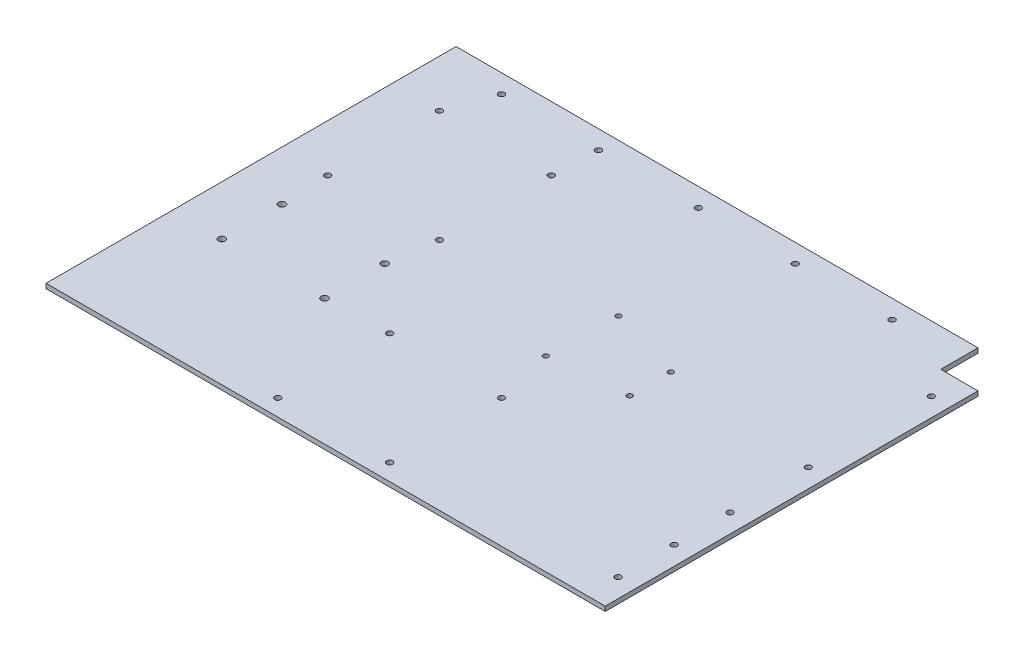
ISO-10303-21;
HEADER;
FILE_DESCRIPTION(('STEP AP214'),'2;1');
FILE_NAME('part.step','',(''),(''),'','','');
FILE_SCHEMA(('AUTOMOTIVE_DESIGN { 1 0 10303 214 1 1 1 1 }'));
ENDSEC;
DATA;
#1=APPLICATION_CONTEXT('core data for automotive mechanical design processes');
#2=APPLICATION_PROTOCOL_DEFINITION('international standard','automotive_design',2000,#1);
#3=PRODUCT_CONTEXT('',#1,'mechanical');
#4=PRODUCT('Part','Part','',(#3));
#5=PRODUCT_RELATED_PRODUCT_CATEGORY('part','',(#4));
#6=PRODUCT_DEFINITION_FORMATION('','',#4);
#7=PRODUCT_DEFINITION_CONTEXT('part definition',#1,'design');
#8=PRODUCT_DEFINITION('design','',#6,#7);
#9=PRODUCT_DEFINITION_SHAPE('','',#8);
#10=(LENGTH_UNIT() NAMED_UNIT(*) SI_UNIT(.MILLI.,.METRE.));
#11=(NAMED_UNIT(*) PLANE_ANGLE_UNIT() SI_UNIT($,.RADIAN.));
#12=(NAMED_UNIT(*) SI_UNIT($,.STERADIAN.) SOLID_ANGLE_UNIT());
#13=UNCERTAINTY_MEASURE_WITH_UNIT(LENGTH_MEASURE(1.E-05),#10,'distance_accuracy_value','');
#14=(GEOMETRIC_REPRESENTATION_CONTEXT(3) GLOBAL_UNCERTAINTY_ASSIGNED_CONTEXT((#13)) GLOBAL_UNIT_ASSIGNED_CONTEXT((#10,
#11,#12)) REPRESENTATION_CONTEXT('',''));
#15=CARTESIAN_POINT('',(0.,0.,0.));
#16=DIRECTION('',(0.,0.,1.));
#17=DIRECTION('',(1.,0.,0.));
#18=AXIS2_PLACEMENT_3D('',#15,#16,#17);
#19=CARTESIAN_POINT('',(100.800624481963,3.175,73.9204579534397));
#20=DIRECTION('',(0.,0.,1.));
#21=DIRECTION('',(1.,0.,0.));
#22=AXIS2_PLACEMENT_3D('',#19,#20,#21);
#23=PLANE('',#22);
#24=DIRECTION('',(-1.,0.,0.));
#25=VECTOR('',#24,1.);
#26=CARTESIAN_POINT('',(100.800624481963,0.,73.9204579534397));
#27=LINE('',#26,#25);
#28=CARTESIAN_POINT('',(100.800624481963,0.,73.9204579534397));
#29=VERTEX_POINT('',#28);
#30=CARTESIAN_POINT('',(-280.199375518037,0.,73.9204579534398));
#31=VERTEX_POINT('',#30);
#32=EDGE_CURVE('E122',#29,#31,#27,.T.);
#33=ORIENTED_EDGE('',*,*,#32,.F.);
#34=DIRECTION('',(0.,-1.,0.));
#35=VECTOR('',#34,1.);
#36=CARTESIAN_POINT('',(100.800624481963,3.175,73.9204579534397));
#37=LINE('',#36,#35);
#38=CARTESIAN_POINT('',(100.800624481963,3.175,73.9204579534397));
#39=VERTEX_POINT('',#38);
#40=EDGE_CURVE('E11',#39,#29,#37,.T.);
#41=ORIENTED_EDGE('',*,*,#40,.F.);
#42=DIRECTION('',(-1.,0.,0.));
#43=VECTOR('',#42,1.);
#44=CARTESIAN_POINT('',(100.800624481963,3.175,73.9204579534397));
#45=LINE('',#44,#43);
#46=CARTESIAN_POINT('',(-280.199375518037,3.175,73.9204579534398));
#47=VERTEX_POINT('',#46);
#48=EDGE_CURVE('E135',#39,#47,#45,.T.);
#49=ORIENTED_EDGE('',*,*,#48,.T.);
#50=DIRECTION('',(0.,-1.,0.));
#51=VECTOR('',#50,1.);
#52=CARTESIAN_POINT('',(-280.199375518037,3.175,73.9204579534398));
#53=LINE('',#52,#51);
#54=EDGE_CURVE('E39',#47,#31,#53,.T.);
#55=ORIENTED_EDGE('',*,*,#54,.T.);
#56=EDGE_LOOP('',(#33,#41,#49,#55));
#57=FACE_BOUND('',#56,.T.);
#58=ADVANCED_FACE('F36',(#57),#23,.T.);
#59=CARTESIAN_POINT('',(100.800624481963,3.175,73.9204579534397));
#60=DIRECTION('',(-1.,0.,0.));
#61=DIRECTION('',(0.,0.,1.));
#62=AXIS2_PLACEMENT_3D('',#59,#60,#61);
#63=PLANE('',#62);
#64=DIRECTION('',(0.,0.,-1.));
#65=VECTOR('',#64,1.);
#66=CARTESIAN_POINT('',(100.800624481963,0.,73.9204579534397));
#67=LINE('',#66,#65);
#68=CARTESIAN_POINT('',(100.800624481963,0.,-180.07954204656));
#69=VERTEX_POINT('',#68);
#70=EDGE_CURVE('E75',#29,#69,#67,.T.);
#71=ORIENTED_EDGE('',*,*,#70,.T.);
#72=DIRECTION('',(0.,-1.,0.));
#73=VECTOR('',#72,1.);
#74=CARTESIAN_POINT('',(100.800624481963,3.175,-180.07954204656));
#75=LINE('',#74,#73);
#76=CARTESIAN_POINT('',(100.800624481963,3.175,-180.07954204656));
#77=VERTEX_POINT('',#76);
#78=EDGE_CURVE('E45',#77,#69,#75,.T.);
#79=ORIENTED_EDGE('',*,*,#78,.F.);
#80=DIRECTION('',(0.,0.,-1.));
#81=VECTOR('',#80,1.);
#82=CARTESIAN_POINT('',(100.800624481963,3.175,73.9204579534397));
#83=LINE('',#82,#81);
#84=EDGE_CURVE('E100',#39,#77,#83,.T.);
#85=ORIENTED_EDGE('',*,*,#84,.F.);
#86=ORIENTED_EDGE('',*,*,#40,.T.);
#87=EDGE_LOOP('',(#71,#79,#85,#86));
#88=FACE_BOUND('',#87,.T.);
#89=ADVANCED_FACE('F377',(#88),#63,.F.);
#90=CARTESIAN_POINT('',(100.800624481963,3.175,-180.07954204656));
#91=DIRECTION('',(0.,0.,1.));
#92=DIRECTION('',(1.,0.,0.));
#93=AXIS2_PLACEMENT_3D('',#90,#91,#92);
#94=PLANE('',#93);
#95=DIRECTION('',(-1.,0.,0.));
#96=VECTOR('',#95,1.);
#97=CARTESIAN_POINT('',(100.800624481963,0.,-180.07954204656));
#98=LINE('',#97,#96);
#99=CARTESIAN_POINT('',(75.4006244819632,0.,-180.07954204656));
#100=VERTEX_POINT('',#99);
#101=EDGE_CURVE('E107',#69,#100,#98,.T.);
#102=ORIENTED_EDGE('',*,*,#101,.T.);
#103=DIRECTION('',(0.,-1.,0.));
#104=VECTOR('',#103,1.);
#105=CARTESIAN_POINT('',(75.4006244819632,3.175,-180.07954204656));
#106=LINE('',#105,#104);
#107=CARTESIAN_POINT('',(75.4006244819632,3.175,-180.07954204656));
#108=VERTEX_POINT('',#107);
#109=EDGE_CURVE('E104',#108,#100,#106,.T.);
#110=ORIENTED_EDGE('',*,*,#109,.F.);
#111=DIRECTION('',(-1.,0.,0.));
#112=VECTOR('',#111,1.);
#113=CARTESIAN_POINT('',(100.800624481963,3.175,-180.07954204656));
#114=LINE('',#113,#112);
#115=EDGE_CURVE('E93',#77,#108,#114,.T.);
#116=ORIENTED_EDGE('',*,*,#115,.F.);
#117=ORIENTED_EDGE('',*,*,#78,.T.);
#118=EDGE_LOOP('',(#102,#110,#116,#117));
#119=FACE_BOUND('',#118,.T.);
#120=ADVANCED_FACE('F105',(#119),#94,.F.);
#121=CARTESIAN_POINT('',(75.4006244819632,3.175,-180.07954204656));
#122=DIRECTION('',(-1.,0.,0.));
#123=DIRECTION('',(0.,0.,1.));
#124=AXIS2_PLACEMENT_3D('',#121,#122,#123);
#125=PLANE('',#124);
#126=DIRECTION('',(0.,0.,-1.));
#127=VECTOR('',#126,1.);
#128=CARTESIAN_POINT('',(75.4006244819632,0.,-180.07954204656));
#129=LINE('',#128,#127);
#130=CARTESIAN_POINT('',(75.4006244819632,0.,-205.47954204656));
#131=VERTEX_POINT('',#130);
#132=EDGE_CURVE('E132',#100,#131,#129,.T.);
#133=ORIENTED_EDGE('',*,*,#132,.T.);
#134=DIRECTION('',(0.,-1.,0.));
#135=VECTOR('',#134,1.);
#136=CARTESIAN_POINT('',(75.4006244819632,3.175,-205.47954204656));
#137=LINE('',#136,#135);
#138=CARTESIAN_POINT('',(75.4006244819632,3.175,-205.47954204656));
#139=VERTEX_POINT('',#138);
#140=EDGE_CURVE('E110',#139,#131,#137,.T.);
#141=ORIENTED_EDGE('',*,*,#140,.F.);
#142=DIRECTION('',(0.,0.,-1.));
#143=VECTOR('',#142,1.);
#144=CARTESIAN_POINT('',(75.4006244819632,3.175,-180.07954204656));
#145=LINE('',#144,#143);
#146=EDGE_CURVE('E98',#108,#139,#145,.T.);
#147=ORIENTED_EDGE('',*,*,#146,.F.);
#148=ORIENTED_EDGE('',*,*,#109,.T.);
#149=EDGE_LOOP('',(#133,#141,#147,#148));
#150=FACE_BOUND('',#149,.T.);
#151=ADVANCED_FACE('F112',(#150),#125,.F.);
#152=CARTESIAN_POINT('',(75.4006244819632,3.175,-205.47954204656));
#153=DIRECTION('',(0.,0.,1.));
#154=DIRECTION('',(1.,0.,0.));
#155=AXIS2_PLACEMENT_3D('',#152,#153,#154);
#156=PLANE('',#155);
#157=DIRECTION('',(-1.,0.,0.));
#158=VECTOR('',#157,1.);
#159=CARTESIAN_POINT('',(75.4006244819632,0.,-205.47954204656));
#160=LINE('',#159,#158);
#161=CARTESIAN_POINT('',(-280.199375518037,0.,-205.47954204656));
#162=VERTEX_POINT('',#161);
#163=EDGE_CURVE('E129',#131,#162,#160,.T.);
#164=ORIENTED_EDGE('',*,*,#163,.T.);
#165=DIRECTION('',(0.,-1.,0.));
#166=VECTOR('',#165,1.);
#167=CARTESIAN_POINT('',(-280.199375518037,3.175,-205.47954204656));
#168=LINE('',#167,#166);
#169=CARTESIAN_POINT('',(-280.199375518037,3.175,-205.47954204656));
#170=VERTEX_POINT('',#169);
#171=EDGE_CURVE('E138',#170,#162,#168,.T.);
#172=ORIENTED_EDGE('',*,*,#171,.F.);
#173=DIRECTION('',(-1.,0.,0.));
#174=VECTOR('',#173,1.);
#175=CARTESIAN_POINT('',(75.4006244819632,3.175,-205.47954204656));
#176=LINE('',#175,#174);
#177=EDGE_CURVE('E115',#139,#170,#176,.T.);
#178=ORIENTED_EDGE('',*,*,#177,.F.);
#179=ORIENTED_EDGE('',*,*,#140,.T.);
#180=EDGE_LOOP('',(#164,#172,#178,#179));
#181=FACE_BOUND('',#180,.T.);
#182=ADVANCED_FACE('F145',(#181),#156,.F.);
#183=CARTESIAN_POINT('',(-280.199375518037,3.175,73.9204579534398));
#184=DIRECTION('',(-1.,0.,0.));
#185=DIRECTION('',(0.,0.,1.));
#186=AXIS2_PLACEMENT_3D('',#183,#184,#185);
#187=PLANE('',#186);
#188=DIRECTION('',(0.,0.,-1.));
#189=VECTOR('',#188,1.);
#190=CARTESIAN_POINT('',(-280.199375518037,0.,73.9204579534398));
#191=LINE('',#190,#189);
#192=EDGE_CURVE('E125',#31,#162,#191,.T.);
#193=ORIENTED_EDGE('',*,*,#192,.F.);
#194=ORIENTED_EDGE('',*,*,#54,.F.);
#195=DIRECTION('',(0.,0.,-1.));
#196=VECTOR('',#195,1.);
#197=CARTESIAN_POINT('',(-280.199375518037,3.175,73.9204579534398));
#198=LINE('',#197,#196);
#199=EDGE_CURVE('E117',#47,#170,#198,.T.);
#200=ORIENTED_EDGE('',*,*,#199,.T.);
#201=ORIENTED_EDGE('',*,*,#171,.T.);
#202=EDGE_LOOP('',(#193,#194,#200,#201));
#203=FACE_BOUND('',#202,.T.);
#204=ADVANCED_FACE('F140',(#203),#187,.T.);
#205=CARTESIAN_POINT('',(0.,3.175,0.));
#206=DIRECTION('',(0.,-1.,0.));
#207=DIRECTION('',(0.,0.,-1.));
#208=AXIS2_PLACEMENT_3D('',#205,#206,#207);
#209=PLANE('',#208);
#210=CARTESIAN_POINT('',(-133.573007219996,3.175,-13.6068536262786));
#211=DIRECTION('',(0.,1.,0.));
#212=DIRECTION('',(0.,0.,1.));
#213=AXIS2_PLACEMENT_3D('',#210,#211,#212);
#214=CIRCLE('',#213,2.03200000000001);
#215=CARTESIAN_POINT('',(-133.573007219996,3.175,-11.5748536262786));
#216=VERTEX_POINT('',#215);
#217=EDGE_CURVE('E274',#216,#216,#214,.T.);
#218=ORIENTED_EDGE('',*,*,#217,.F.);
#219=EDGE_LOOP('',(#218));
#220=FACE_BOUND('',#219,.T.);
#221=CARTESIAN_POINT('',(-247.907630969314,3.175,-85.6493101095466));
#222=DIRECTION('',(0.,1.,0.));
#223=DIRECTION('',(0.,0.,1.));
#224=AXIS2_PLACEMENT_3D('',#221,#222,#223);
#225=CIRCLE('',#224,2.03200000000001);
#226=CARTESIAN_POINT('',(-247.907630969314,3.175,-83.6173101095466));
#227=VERTEX_POINT('',#226);
#228=EDGE_CURVE('E281',#227,#227,#225,.T.);
#229=ORIENTED_EDGE('',*,*,#228,.F.);
#230=EDGE_LOOP('',(#229));
#231=FACE_BOUND('',#230,.T.);
#232=CARTESIAN_POINT('',(-171.707630969314,3.175,-85.6493101095466));
#233=DIRECTION('',(0.,1.,0.));
#234=DIRECTION('',(0.,0.,1.));
#235=AXIS2_PLACEMENT_3D('',#232,#233,#234);
#236=CIRCLE('',#235,2.03200000000001);
#237=CARTESIAN_POINT('',(-171.707630969314,3.175,-83.6173101095466));
#238=VERTEX_POINT('',#237);
#239=EDGE_CURVE('E262',#238,#238,#236,.T.);
#240=ORIENTED_EDGE('',*,*,#239,.F.);
#241=EDGE_LOOP('',(#240));
#242=FACE_BOUND('',#241,.T.);
#243=CARTESIAN_POINT('',(-171.707630969314,3.175,-161.849310109547));
#244=DIRECTION('',(0.,1.,0.));
#245=DIRECTION('',(0.,0.,1.));
#246=AXIS2_PLACEMENT_3D('',#243,#244,#245);
#247=CIRCLE('',#246,2.032);
#248=CARTESIAN_POINT('',(-171.707630969314,3.175,-159.817310109547));
#249=VERTEX_POINT('',#248);
#250=EDGE_CURVE('E269',#249,#249,#247,.T.);
#251=ORIENTED_EDGE('',*,*,#250,.F.);
#252=EDGE_LOOP('',(#251));
#253=FACE_BOUND('',#252,.T.);
#254=CARTESIAN_POINT('',(-57.3730072199961,3.175,-13.6068536262786));
#255=DIRECTION('',(0.,1.,0.));
#256=DIRECTION('',(0.,0.,1.));
#257=AXIS2_PLACEMENT_3D('',#254,#255,#256);
#258=CIRCLE('',#257,2.032);
#259=CARTESIAN_POINT('',(-57.3730072199961,3.175,-11.5748536262786));
#260=VERTEX_POINT('',#259);
#261=EDGE_CURVE('E298',#260,#260,#258,.T.);
#262=ORIENTED_EDGE('',*,*,#261,.F.);
#263=EDGE_LOOP('',(#262));
#264=FACE_BOUND('',#263,.T.);
#265=CARTESIAN_POINT('',(-57.3730072199961,3.175,62.5931463737214));
#266=DIRECTION('',(0.,1.,0.));
#267=DIRECTION('',(0.,0.,1.));
#268=AXIS2_PLACEMENT_3D('',#265,#266,#267);
#269=CIRCLE('',#268,2.03199999999999);
#270=CARTESIAN_POINT('',(-57.3730072199961,3.175,64.6251463737214));
#271=VERTEX_POINT('',#270);
#272=EDGE_CURVE('E292',#271,#271,#269,.T.);
#273=ORIENTED_EDGE('',*,*,#272,.F.);
#274=EDGE_LOOP('',(#273));
#275=FACE_BOUND('',#274,.T.);
#276=CARTESIAN_POINT('',(-133.573007219996,3.175,62.5931463737214));
#277=DIRECTION('',(0.,1.,0.));
#278=DIRECTION('',(0.,0.,1.));
#279=AXIS2_PLACEMENT_3D('',#276,#277,#278);
#280=CIRCLE('',#279,2.03200000000001);
#281=CARTESIAN_POINT('',(-133.573007219996,3.175,64.6251463737214));
#282=VERTEX_POINT('',#281);
#283=EDGE_CURVE('E286',#282,#282,#280,.T.);
#284=ORIENTED_EDGE('',*,*,#283,.F.);
#285=EDGE_LOOP('',(#284));
#286=FACE_BOUND('',#285,.T.);
#287=CARTESIAN_POINT('',(-247.907630969314,3.175,-161.849310109547));
#288=DIRECTION('',(0.,1.,0.));
#289=DIRECTION('',(0.,0.,1.));
#290=AXIS2_PLACEMENT_3D('',#287,#288,#289);
#291=CIRCLE('',#290,2.032);
#292=CARTESIAN_POINT('',(-247.907630969314,3.175,-159.817310109547));
#293=VERTEX_POINT('',#292);
#294=EDGE_CURVE('E256',#293,#293,#291,.T.);
#295=ORIENTED_EDGE('',*,*,#294,.F.);
#296=EDGE_LOOP('',(#295));
#297=FACE_BOUND('',#296,.T.);
#298=CARTESIAN_POINT('',(-246.392967043811,3.175,-12.0872192801936));
#299=DIRECTION('',(0.,1.,0.));
#300=DIRECTION('',(0.,0.,1.));
#301=AXIS2_PLACEMENT_3D('',#298,#299,#300);
#302=CIRCLE('',#301,2.34746475532095);
#303=CARTESIAN_POINT('',(-246.392967043811,3.175,-9.73975452487267));
#304=VERTEX_POINT('',#303);
#305=EDGE_CURVE('E238',#304,#304,#302,.T.);
#306=ORIENTED_EDGE('',*,*,#305,.F.);
#307=EDGE_LOOP('',(#306));
#308=FACE_BOUND('',#307,.T.);
#309=CARTESIAN_POINT('',(-176.42696274833,3.175,-12.0872192801936));
#310=DIRECTION('',(0.,1.,0.));
#311=DIRECTION('',(0.,0.,1.));
#312=AXIS2_PLACEMENT_3D('',#309,#310,#311);
#313=CIRCLE('',#312,2.34746475532092);
#314=CARTESIAN_POINT('',(-176.42696274833,3.175,-9.73975452487272));
#315=VERTEX_POINT('',#314);
#316=EDGE_CURVE('E245',#315,#315,#313,.T.);
#317=ORIENTED_EDGE('',*,*,#316,.F.);
#318=EDGE_LOOP('',(#317));
#319=FACE_BOUND('',#318,.T.);
#320=CARTESIAN_POINT('',(-176.42696274833,3.175,-53.0795420465603));
#321=DIRECTION('',(0.,1.,0.));
#322=DIRECTION('',(0.,0.,1.));
#323=AXIS2_PLACEMENT_3D('',#320,#321,#322);
#324=CIRCLE('',#323,2.34746475532095);
#325=CARTESIAN_POINT('',(-176.42696274833,3.175,-50.7320772912394));
#326=VERTEX_POINT('',#325);
#327=EDGE_CURVE('E251',#326,#326,#324,.T.);
#328=ORIENTED_EDGE('',*,*,#327,.F.);
#329=EDGE_LOOP('',(#328));
#330=FACE_BOUND('',#329,.T.);
#331=CARTESIAN_POINT('',(-246.392967043811,3.175,-53.0795420465603));
#332=DIRECTION('',(0.,1.,0.));
#333=DIRECTION('',(0.,0.,1.));
#334=AXIS2_PLACEMENT_3D('',#331,#332,#333);
#335=CIRCLE('',#334,2.34746475532092);
#336=CARTESIAN_POINT('',(-246.392967043811,3.175,-50.7320772912394));
#337=VERTEX_POINT('',#336);
#338=EDGE_CURVE('E232',#337,#337,#335,.T.);
#339=ORIENTED_EDGE('',*,*,#338,.F.);
#340=EDGE_LOOP('',(#339));
#341=FACE_BOUND('',#340,.T.);
#342=CARTESIAN_POINT('',(-65.7828975691929,3.175,-101.772937610948));
#343=DIRECTION('',(0.,1.,0.));
#344=DIRECTION('',(0.,0.,1.));
#345=AXIS2_PLACEMENT_3D('',#342,#343,#344);
#346=CIRCLE('',#345,1.77799999999999);
#347=CARTESIAN_POINT('',(-65.7828975691929,3.175,-99.994937610948));
#348=VERTEX_POINT('',#347);
#349=EDGE_CURVE('E214',#348,#348,#346,.T.);
#350=ORIENTED_EDGE('',*,*,#349,.F.);
#351=EDGE_LOOP('',(#350));
#352=FACE_BOUND('',#351,.T.);
#353=CARTESIAN_POINT('',(-67.0528975691929,3.175,-53.512937610948));
#354=DIRECTION('',(0.,1.,0.));
#355=DIRECTION('',(0.,0.,1.));
#356=AXIS2_PLACEMENT_3D('',#353,#354,#355);
#357=CIRCLE('',#356,1.77799999999999);
#358=CARTESIAN_POINT('',(-67.0528975691929,3.175,-51.734937610948));
#359=VERTEX_POINT('',#358);
#360=EDGE_CURVE('E221',#359,#359,#357,.T.);
#361=ORIENTED_EDGE('',*,*,#360,.F.);
#362=EDGE_LOOP('',(#361));
#363=FACE_BOUND('',#362,.T.);
#364=CARTESIAN_POINT('',(-14.9828975691929,3.175,-58.592937610948));
#365=DIRECTION('',(0.,1.,0.));
#366=DIRECTION('',(0.,0.,1.));
#367=AXIS2_PLACEMENT_3D('',#364,#365,#366);
#368=CIRCLE('',#367,1.77799999999999);
#369=CARTESIAN_POINT('',(-14.9828975691929,3.175,-56.814937610948));
#370=VERTEX_POINT('',#369);
#371=EDGE_CURVE('E227',#370,#370,#368,.T.);
#372=ORIENTED_EDGE('',*,*,#371,.F.);
#373=EDGE_LOOP('',(#372));
#374=FACE_BOUND('',#373,.T.);
#375=CARTESIAN_POINT('',(-14.9828975691929,3.175,-86.532937610948));
#376=DIRECTION('',(0.,1.,0.));
#377=DIRECTION('',(0.,0.,1.));
#378=AXIS2_PLACEMENT_3D('',#375,#376,#377);
#379=CIRCLE('',#378,1.778);
#380=CARTESIAN_POINT('',(-14.9828975691929,3.175,-84.754937610948));
#381=VERTEX_POINT('',#380);
#382=EDGE_CURVE('E208',#381,#381,#379,.T.);
#383=ORIENTED_EDGE('',*,*,#382,.F.);
#384=EDGE_LOOP('',(#383));
#385=FACE_BOUND('',#384,.T.);
#386=CARTESIAN_POINT('',(88.1006244819632,3.175,-161.02954204656));
#387=DIRECTION('',(0.,1.,0.));
#388=DIRECTION('',(0.,0.,1.));
#389=AXIS2_PLACEMENT_3D('',#386,#387,#388);
#390=CIRCLE('',#389,2.032);
#391=CARTESIAN_POINT('',(88.1006244819632,3.175,-158.99754204656));
#392=VERTEX_POINT('',#391);
#393=EDGE_CURVE('E203',#392,#392,#390,.T.);
#394=ORIENTED_EDGE('',*,*,#393,.F.);
#395=EDGE_LOOP('',(#394));
#396=FACE_BOUND('',#395,.T.);
#397=CARTESIAN_POINT('',(88.1006244819632,3.175,-77.2095420465603));
#398=DIRECTION('',(0.,1.,0.));
#399=DIRECTION('',(0.,0.,1.));
#400=AXIS2_PLACEMENT_3D('',#397,#398,#399);
#401=CIRCLE('',#400,2.03200000000001);
#402=CARTESIAN_POINT('',(88.1006244819632,3.175,-75.1775420465603));
#403=VERTEX_POINT('',#402);
#404=EDGE_CURVE('E197',#403,#403,#401,.T.);
#405=ORIENTED_EDGE('',*,*,#404,.F.);
#406=EDGE_LOOP('',(#405));
#407=FACE_BOUND('',#406,.T.);
#408=CARTESIAN_POINT('',(88.1006244819632,3.175,-23.8202508425131));
#409=DIRECTION('',(0.,1.,0.));
#410=DIRECTION('',(0.,0.,1.));
#411=AXIS2_PLACEMENT_3D('',#408,#409,#410);
#412=CIRCLE('',#411,2.03200000000001);
#413=CARTESIAN_POINT('',(88.1006244819632,3.175,-21.7882508425131));
#414=VERTEX_POINT('',#413);
#415=EDGE_CURVE('E191',#414,#414,#412,.T.);
#416=ORIENTED_EDGE('',*,*,#415,.F.);
#417=EDGE_LOOP('',(#416));
#418=FACE_BOUND('',#417,.T.);
#419=CARTESIAN_POINT('',(88.1006244819636,3.175,14.2797491574869));
#420=DIRECTION('',(0.,1.,0.));
#421=DIRECTION('',(0.,0.,1.));
#422=AXIS2_PLACEMENT_3D('',#419,#420,#421);
#423=CIRCLE('',#422,2.03200000000001);
#424=CARTESIAN_POINT('',(88.1006244819636,3.175,16.3117491574869));
#425=VERTEX_POINT('',#424);
#426=EDGE_CURVE('E185',#425,#425,#423,.T.);
#427=ORIENTED_EDGE('',*,*,#426,.F.);
#428=EDGE_LOOP('',(#427));
#429=FACE_BOUND('',#428,.T.);
#430=CARTESIAN_POINT('',(88.100624481964,3.175,52.3797491574869));
#431=DIRECTION('',(0.,1.,0.));
#432=DIRECTION('',(0.,0.,1.));
#433=AXIS2_PLACEMENT_3D('',#430,#431,#432);
#434=CIRCLE('',#433,2.03200000000001);
#435=CARTESIAN_POINT('',(88.100624481964,3.175,54.4117491574869));
#436=VERTEX_POINT('',#435);
#437=EDGE_CURVE('E178',#436,#436,#434,.T.);
#438=ORIENTED_EDGE('',*,*,#437,.F.);
#439=EDGE_LOOP('',(#438));
#440=FACE_BOUND('',#439,.T.);
#441=CARTESIAN_POINT('',(-102.399375518037,3.175,-192.77954204656));
#442=DIRECTION('',(0.,1.,0.));
#443=DIRECTION('',(0.,0.,1.));
#444=AXIS2_PLACEMENT_3D('',#441,#442,#443);
#445=CIRCLE('',#444,2.032);
#446=CARTESIAN_POINT('',(-102.399375518037,3.175,-190.74754204656));
#447=VERTEX_POINT('',#446);
#448=EDGE_CURVE('E161',#447,#447,#445,.T.);
#449=ORIENTED_EDGE('',*,*,#448,.F.);
#450=EDGE_LOOP('',(#449));
#451=FACE_BOUND('',#450,.T.);
#452=CARTESIAN_POINT('',(-36.4851982812551,3.175,-192.77954204656));
#453=DIRECTION('',(0.,1.,0.));
#454=DIRECTION('',(0.,0.,1.));
#455=AXIS2_PLACEMENT_3D('',#452,#453,#454);
#456=CIRCLE('',#455,2.032);
#457=CARTESIAN_POINT('',(-36.4851982812551,3.175,-190.74754204656));
#458=VERTEX_POINT('',#457);
#459=EDGE_CURVE('E154',#458,#458,#456,.T.);
#460=ORIENTED_EDGE('',*,*,#459,.F.);
#461=EDGE_LOOP('',(#460));
#462=FACE_BOUND('',#461,.T.);
#463=CARTESIAN_POINT('',(-236.544769223729,3.175,-192.77954204656));
#464=DIRECTION('',(0.,1.,0.));
#465=DIRECTION('',(0.,0.,1.));
#466=AXIS2_PLACEMENT_3D('',#463,#464,#465);
#467=CIRCLE('',#466,2.032);
#468=CARTESIAN_POINT('',(-236.544769223729,3.175,-190.74754204656));
#469=VERTEX_POINT('',#468);
#470=EDGE_CURVE('E173',#469,#469,#467,.T.);
#471=ORIENTED_EDGE('',*,*,#470,.F.);
#472=EDGE_LOOP('',(#471));
#473=FACE_BOUND('',#472,.T.);
#474=CARTESIAN_POINT('',(29.5548017187449,3.175,-192.77954204656));
#475=DIRECTION('',(0.,1.,0.));
#476=DIRECTION('',(0.,0.,1.));
#477=AXIS2_PLACEMENT_3D('',#474,#475,#476);
#478=CIRCLE('',#477,2.032);
#479=CARTESIAN_POINT('',(29.5548017187449,3.175,-190.74754204656));
#480=VERTEX_POINT('',#479);
#481=EDGE_CURVE('E166',#480,#480,#478,.T.);
#482=ORIENTED_EDGE('',*,*,#481,.F.);
#483=EDGE_LOOP('',(#482));
#484=FACE_BOUND('',#483,.T.);
#485=CARTESIAN_POINT('',(-170.504769223729,3.175,-192.77954204656));
#486=DIRECTION('',(0.,1.,0.));
#487=DIRECTION('',(0.,0.,1.));
#488=AXIS2_PLACEMENT_3D('',#485,#486,#487);
#489=CIRCLE('',#488,2.032);
#490=CARTESIAN_POINT('',(-170.504769223729,3.175,-190.74754204656));
#491=VERTEX_POINT('',#490);
#492=EDGE_CURVE('E148',#491,#491,#489,.T.);
#493=ORIENTED_EDGE('',*,*,#492,.F.);
#494=EDGE_LOOP('',(#493));
#495=FACE_BOUND('',#494,.T.);
#496=ORIENTED_EDGE('',*,*,#48,.F.);
#497=ORIENTED_EDGE('',*,*,#84,.T.);
#498=ORIENTED_EDGE('',*,*,#115,.T.);
#499=ORIENTED_EDGE('',*,*,#146,.T.);
#500=ORIENTED_EDGE('',*,*,#177,.T.);
#501=ORIENTED_EDGE('',*,*,#199,.F.);
#502=EDGE_LOOP('',(#496,#497,#498,#499,#500,#501));
#503=FACE_BOUND('',#502,.T.);
#504=ADVANCED_FACE('F96',(#220,#231,#242,#253,#264,#275,#286,#297,#308,#319,#330,#341,#352,#363,
#374,#385,#396,#407,#418,#429,#440,#451,#462,#473,#484,#495,#503),#209,.F.);
#505=CARTESIAN_POINT('',(0.,0.,0.));
#506=DIRECTION('',(0.,-1.,0.));
#507=DIRECTION('',(0.,0.,-1.));
#508=AXIS2_PLACEMENT_3D('',#505,#506,#507);
#509=PLANE('',#508);
#510=CARTESIAN_POINT('',(-133.573007219996,0.,-13.6068536262786));
#511=DIRECTION('',(0.,1.,0.));
#512=DIRECTION('',(0.,0.,1.));
#513=AXIS2_PLACEMENT_3D('',#510,#511,#512);
#514=CIRCLE('',#513,2.03200000000001);
#515=CARTESIAN_POINT('',(-133.573007219996,0.,-11.5748536262786));
#516=VERTEX_POINT('',#515);
#517=EDGE_CURVE('E277',#516,#516,#514,.T.);
#518=ORIENTED_EDGE('',*,*,#517,.T.);
#519=EDGE_LOOP('',(#518));
#520=FACE_BOUND('',#519,.T.);
#521=CARTESIAN_POINT('',(-247.907630969314,0.,-85.6493101095466));
#522=DIRECTION('',(0.,1.,0.));
#523=DIRECTION('',(0.,0.,1.));
#524=AXIS2_PLACEMENT_3D('',#521,#522,#523);
#525=CIRCLE('',#524,2.03200000000001);
#526=CARTESIAN_POINT('',(-247.907630969314,0.,-83.6173101095466));
#527=VERTEX_POINT('',#526);
#528=EDGE_CURVE('E266',#527,#527,#525,.T.);
#529=ORIENTED_EDGE('',*,*,#528,.T.);
#530=EDGE_LOOP('',(#529));
#531=FACE_BOUND('',#530,.T.);
#532=CARTESIAN_POINT('',(-171.707630969314,0.,-85.6493101095466));
#533=DIRECTION('',(0.,1.,0.));
#534=DIRECTION('',(0.,0.,1.));
#535=AXIS2_PLACEMENT_3D('',#532,#533,#534);
#536=CIRCLE('',#535,2.03200000000001);
#537=CARTESIAN_POINT('',(-171.707630969314,0.,-83.6173101095466));
#538=VERTEX_POINT('',#537);
#539=EDGE_CURVE('E265',#538,#538,#536,.T.);
#540=ORIENTED_EDGE('',*,*,#539,.T.);
#541=EDGE_LOOP('',(#540));
#542=FACE_BOUND('',#541,.T.);
#543=CARTESIAN_POINT('',(-171.707630969314,0.,-161.849310109547));
#544=DIRECTION('',(0.,1.,0.));
#545=DIRECTION('',(0.,0.,1.));
#546=AXIS2_PLACEMENT_3D('',#543,#544,#545);
#547=CIRCLE('',#546,2.032);
#548=CARTESIAN_POINT('',(-171.707630969314,0.,-159.817310109547));
#549=VERTEX_POINT('',#548);
#550=EDGE_CURVE('E259',#549,#549,#547,.T.);
#551=ORIENTED_EDGE('',*,*,#550,.T.);
#552=EDGE_LOOP('',(#551));
#553=FACE_BOUND('',#552,.T.);
#554=CARTESIAN_POINT('',(-57.3730072199961,0.,-13.6068536262786));
#555=DIRECTION('',(0.,1.,0.));
#556=DIRECTION('',(0.,0.,1.));
#557=AXIS2_PLACEMENT_3D('',#554,#555,#556);
#558=CIRCLE('',#557,2.032);
#559=CARTESIAN_POINT('',(-57.3730072199961,0.,-11.5748536262786));
#560=VERTEX_POINT('',#559);
#561=EDGE_CURVE('E278',#560,#560,#558,.T.);
#562=ORIENTED_EDGE('',*,*,#561,.T.);
#563=EDGE_LOOP('',(#562));
#564=FACE_BOUND('',#563,.T.);
#565=CARTESIAN_POINT('',(-57.3730072199961,0.,62.5931463737214));
#566=DIRECTION('',(0.,1.,0.));
#567=DIRECTION('',(0.,0.,1.));
#568=AXIS2_PLACEMENT_3D('',#565,#566,#567);
#569=CIRCLE('',#568,2.03199999999999);
#570=CARTESIAN_POINT('',(-57.3730072199961,0.,64.6251463737214));
#571=VERTEX_POINT('',#570);
#572=EDGE_CURVE('E295',#571,#571,#569,.T.);
#573=ORIENTED_EDGE('',*,*,#572,.T.);
#574=EDGE_LOOP('',(#573));
#575=FACE_BOUND('',#574,.T.);
#576=CARTESIAN_POINT('',(-133.573007219996,0.,62.5931463737214));
#577=DIRECTION('',(0.,1.,0.));
#578=DIRECTION('',(0.,0.,1.));
#579=AXIS2_PLACEMENT_3D('',#576,#577,#578);
#580=CIRCLE('',#579,2.03200000000001);
#581=CARTESIAN_POINT('',(-133.573007219996,0.,64.6251463737214));
#582=VERTEX_POINT('',#581);
#583=EDGE_CURVE('E289',#582,#582,#580,.T.);
#584=ORIENTED_EDGE('',*,*,#583,.T.);
#585=EDGE_LOOP('',(#584));
#586=FACE_BOUND('',#585,.T.);
#587=CARTESIAN_POINT('',(-247.907630969314,0.,-161.849310109547));
#588=DIRECTION('',(0.,1.,0.));
#589=DIRECTION('',(0.,0.,1.));
#590=AXIS2_PLACEMENT_3D('',#587,#588,#589);
#591=CIRCLE('',#590,2.032);
#592=CARTESIAN_POINT('',(-247.907630969314,0.,-159.817310109547));
#593=VERTEX_POINT('',#592);
#594=EDGE_CURVE('E242',#593,#593,#591,.T.);
#595=ORIENTED_EDGE('',*,*,#594,.T.);
#596=EDGE_LOOP('',(#595));
#597=FACE_BOUND('',#596,.T.);
#598=CARTESIAN_POINT('',(-246.392967043811,0.,-12.0872192801936));
#599=DIRECTION('',(0.,1.,0.));
#600=DIRECTION('',(0.,0.,1.));
#601=AXIS2_PLACEMENT_3D('',#598,#599,#600);
#602=CIRCLE('',#601,2.34746475532095);
#603=CARTESIAN_POINT('',(-246.392967043811,0.,-9.73975452487267));
#604=VERTEX_POINT('',#603);
#605=EDGE_CURVE('E241',#604,#604,#602,.T.);
#606=ORIENTED_EDGE('',*,*,#605,.T.);
#607=EDGE_LOOP('',(#606));
#608=FACE_BOUND('',#607,.T.);
#609=CARTESIAN_POINT('',(-176.42696274833,0.,-12.0872192801936));
#610=DIRECTION('',(0.,1.,0.));
#611=DIRECTION('',(0.,0.,1.));
#612=AXIS2_PLACEMENT_3D('',#609,#610,#611);
#613=CIRCLE('',#612,2.34746475532092);
#614=CARTESIAN_POINT('',(-176.42696274833,0.,-9.73975452487272));
#615=VERTEX_POINT('',#614);
#616=EDGE_CURVE('E248',#615,#615,#613,.T.);
#617=ORIENTED_EDGE('',*,*,#616,.T.);
#618=EDGE_LOOP('',(#617));
#619=FACE_BOUND('',#618,.T.);
#620=CARTESIAN_POINT('',(-176.42696274833,0.,-53.0795420465603));
#621=DIRECTION('',(0.,1.,0.));
#622=DIRECTION('',(0.,0.,1.));
#623=AXIS2_PLACEMENT_3D('',#620,#621,#622);
#624=CIRCLE('',#623,2.34746475532095);
#625=CARTESIAN_POINT('',(-176.42696274833,0.,-50.7320772912394));
#626=VERTEX_POINT('',#625);
#627=EDGE_CURVE('E235',#626,#626,#624,.T.);
#628=ORIENTED_EDGE('',*,*,#627,.T.);
#629=EDGE_LOOP('',(#628));
#630=FACE_BOUND('',#629,.T.);
#631=CARTESIAN_POINT('',(-246.392967043811,0.,-53.0795420465603));
#632=DIRECTION('',(0.,1.,0.));
#633=DIRECTION('',(0.,0.,1.));
#634=AXIS2_PLACEMENT_3D('',#631,#632,#633);
#635=CIRCLE('',#634,2.34746475532092);
#636=CARTESIAN_POINT('',(-246.392967043811,0.,-50.7320772912394));
#637=VERTEX_POINT('',#636);
#638=EDGE_CURVE('E218',#637,#637,#635,.T.);
#639=ORIENTED_EDGE('',*,*,#638,.T.);
#640=EDGE_LOOP('',(#639));
#641=FACE_BOUND('',#640,.T.);
#642=CARTESIAN_POINT('',(-65.7828975691929,0.,-101.772937610948));
#643=DIRECTION('',(0.,1.,0.));
#644=DIRECTION('',(0.,0.,1.));
#645=AXIS2_PLACEMENT_3D('',#642,#643,#644);
#646=CIRCLE('',#645,1.77799999999999);
#647=CARTESIAN_POINT('',(-65.7828975691929,0.,-99.994937610948));
#648=VERTEX_POINT('',#647);
#649=EDGE_CURVE('E217',#648,#648,#646,.T.);
#650=ORIENTED_EDGE('',*,*,#649,.T.);
#651=EDGE_LOOP('',(#650));
#652=FACE_BOUND('',#651,.T.);
#653=CARTESIAN_POINT('',(-67.0528975691929,0.,-53.512937610948));
#654=DIRECTION('',(0.,1.,0.));
#655=DIRECTION('',(0.,0.,1.));
#656=AXIS2_PLACEMENT_3D('',#653,#654,#655);
#657=CIRCLE('',#656,1.77799999999999);
#658=CARTESIAN_POINT('',(-67.0528975691929,0.,-51.734937610948));
#659=VERTEX_POINT('',#658);
#660=EDGE_CURVE('E224',#659,#659,#657,.T.);
#661=ORIENTED_EDGE('',*,*,#660,.T.);
#662=EDGE_LOOP('',(#661));
#663=FACE_BOUND('',#662,.T.);
#664=CARTESIAN_POINT('',(-14.9828975691929,0.,-58.592937610948));
#665=DIRECTION('',(0.,1.,0.));
#666=DIRECTION('',(0.,0.,1.));
#667=AXIS2_PLACEMENT_3D('',#664,#665,#666);
#668=CIRCLE('',#667,1.77799999999999);
#669=CARTESIAN_POINT('',(-14.9828975691929,0.,-56.814937610948));
#670=VERTEX_POINT('',#669);
#671=EDGE_CURVE('E211',#670,#670,#668,.T.);
#672=ORIENTED_EDGE('',*,*,#671,.T.);
#673=EDGE_LOOP('',(#672));
#674=FACE_BOUND('',#673,.T.);
#675=CARTESIAN_POINT('',(-14.9828975691929,0.,-86.532937610948));
#676=DIRECTION('',(0.,1.,0.));
#677=DIRECTION('',(0.,0.,1.));
#678=AXIS2_PLACEMENT_3D('',#675,#676,#677);
#679=CIRCLE('',#678,1.778);
#680=CARTESIAN_POINT('',(-14.9828975691929,0.,-84.754937610948));
#681=VERTEX_POINT('',#680);
#682=EDGE_CURVE('E182',#681,#681,#679,.T.);
#683=ORIENTED_EDGE('',*,*,#682,.T.);
#684=EDGE_LOOP('',(#683));
#685=FACE_BOUND('',#684,.T.);
#686=CARTESIAN_POINT('',(88.1006244819632,0.,-161.02954204656));
#687=DIRECTION('',(0.,1.,0.));
#688=DIRECTION('',(0.,0.,1.));
#689=AXIS2_PLACEMENT_3D('',#686,#687,#688);
#690=CIRCLE('',#689,2.032);
#691=CARTESIAN_POINT('',(88.1006244819632,0.,-158.99754204656));
#692=VERTEX_POINT('',#691);
#693=EDGE_CURVE('E170',#692,#692,#690,.T.);
#694=ORIENTED_EDGE('',*,*,#693,.T.);
#695=EDGE_LOOP('',(#694));
#696=FACE_BOUND('',#695,.T.);
#697=CARTESIAN_POINT('',(88.1006244819632,0.,-77.2095420465603));
#698=DIRECTION('',(0.,1.,0.));
#699=DIRECTION('',(0.,0.,1.));
#700=AXIS2_PLACEMENT_3D('',#697,#698,#699);
#701=CIRCLE('',#700,2.03200000000001);
#702=CARTESIAN_POINT('',(88.1006244819632,0.,-75.1775420465603));
#703=VERTEX_POINT('',#702);
#704=EDGE_CURVE('E200',#703,#703,#701,.T.);
#705=ORIENTED_EDGE('',*,*,#704,.T.);
#706=EDGE_LOOP('',(#705));
#707=FACE_BOUND('',#706,.T.);
#708=CARTESIAN_POINT('',(88.1006244819632,0.,-23.8202508425131));
#709=DIRECTION('',(0.,1.,0.));
#710=DIRECTION('',(0.,0.,1.));
#711=AXIS2_PLACEMENT_3D('',#708,#709,#710);
#712=CIRCLE('',#711,2.03200000000001);
#713=CARTESIAN_POINT('',(88.1006244819632,0.,-21.7882508425131));
#714=VERTEX_POINT('',#713);
#715=EDGE_CURVE('E194',#714,#714,#712,.T.);
#716=ORIENTED_EDGE('',*,*,#715,.T.);
#717=EDGE_LOOP('',(#716));
#718=FACE_BOUND('',#717,.T.);
#719=CARTESIAN_POINT('',(88.1006244819636,0.,14.2797491574869));
#720=DIRECTION('',(0.,1.,0.));
#721=DIRECTION('',(0.,0.,1.));
#722=AXIS2_PLACEMENT_3D('',#719,#720,#721);
#723=CIRCLE('',#722,2.03200000000001);
#724=CARTESIAN_POINT('',(88.1006244819636,0.,16.3117491574869));
#725=VERTEX_POINT('',#724);
#726=EDGE_CURVE('E188',#725,#725,#723,.T.);
#727=ORIENTED_EDGE('',*,*,#726,.T.);
#728=EDGE_LOOP('',(#727));
#729=FACE_BOUND('',#728,.T.);
#730=CARTESIAN_POINT('',(88.100624481964,0.,52.3797491574869));
#731=DIRECTION('',(0.,1.,0.));
#732=DIRECTION('',(0.,0.,1.));
#733=AXIS2_PLACEMENT_3D('',#730,#731,#732);
#734=CIRCLE('',#733,2.03200000000001);
#735=CARTESIAN_POINT('',(88.100624481964,0.,54.4117491574869));
#736=VERTEX_POINT('',#735);
#737=EDGE_CURVE('E181',#736,#736,#734,.T.);
#738=ORIENTED_EDGE('',*,*,#737,.T.);
#739=EDGE_LOOP('',(#738));
#740=FACE_BOUND('',#739,.T.);
#741=CARTESIAN_POINT('',(-102.399375518037,0.,-192.77954204656));
#742=DIRECTION('',(0.,1.,0.));
#743=DIRECTION('',(0.,0.,1.));
#744=AXIS2_PLACEMENT_3D('',#741,#742,#743);
#745=CIRCLE('',#744,2.032);
#746=CARTESIAN_POINT('',(-102.399375518037,0.,-190.74754204656));
#747=VERTEX_POINT('',#746);
#748=EDGE_CURVE('E151',#747,#747,#745,.T.);
#749=ORIENTED_EDGE('',*,*,#748,.T.);
#750=EDGE_LOOP('',(#749));
#751=FACE_BOUND('',#750,.T.);
#752=CARTESIAN_POINT('',(-36.4851982812551,0.,-192.77954204656));
#753=DIRECTION('',(0.,1.,0.));
#754=DIRECTION('',(0.,0.,1.));
#755=AXIS2_PLACEMENT_3D('',#752,#753,#754);
#756=CIRCLE('',#755,2.032);
#757=CARTESIAN_POINT('',(-36.4851982812551,0.,-190.74754204656));
#758=VERTEX_POINT('',#757);
#759=EDGE_CURVE('E157',#758,#758,#756,.T.);
#760=ORIENTED_EDGE('',*,*,#759,.T.);
#761=EDGE_LOOP('',(#760));
#762=FACE_BOUND('',#761,.T.);
#763=CARTESIAN_POINT('',(-236.544769223729,0.,-192.77954204656));
#764=DIRECTION('',(0.,1.,0.));
#765=DIRECTION('',(0.,0.,1.));
#766=AXIS2_PLACEMENT_3D('',#763,#764,#765);
#767=CIRCLE('',#766,2.032);
#768=CARTESIAN_POINT('',(-236.544769223729,0.,-190.74754204656));
#769=VERTEX_POINT('',#768);
#770=EDGE_CURVE('E158',#769,#769,#767,.T.);
#771=ORIENTED_EDGE('',*,*,#770,.T.);
#772=EDGE_LOOP('',(#771));
#773=FACE_BOUND('',#772,.T.);
#774=CARTESIAN_POINT('',(29.5548017187449,0.,-192.77954204656));
#775=DIRECTION('',(0.,1.,0.));
#776=DIRECTION('',(0.,0.,1.));
#777=AXIS2_PLACEMENT_3D('',#774,#775,#776);
#778=CIRCLE('',#777,2.032);
#779=CARTESIAN_POINT('',(29.5548017187449,0.,-190.74754204656));
#780=VERTEX_POINT('',#779);
#781=EDGE_CURVE('E169',#780,#780,#778,.T.);
#782=ORIENTED_EDGE('',*,*,#781,.T.);
#783=EDGE_LOOP('',(#782));
#784=FACE_BOUND('',#783,.T.);
#785=CARTESIAN_POINT('',(-170.504769223729,0.,-192.77954204656));
#786=DIRECTION('',(0.,1.,0.));
#787=DIRECTION('',(0.,0.,1.));
#788=AXIS2_PLACEMENT_3D('',#785,#786,#787);
#789=CIRCLE('',#788,2.032);
#790=CARTESIAN_POINT('',(-170.504769223729,0.,-190.74754204656));
#791=VERTEX_POINT('',#790);
#792=EDGE_CURVE('E126',#791,#791,#789,.T.);
#793=ORIENTED_EDGE('',*,*,#792,.T.);
#794=EDGE_LOOP('',(#793));
#795=FACE_BOUND('',#794,.T.);
#796=ORIENTED_EDGE('',*,*,#32,.T.);
#797=ORIENTED_EDGE('',*,*,#192,.T.);
#798=ORIENTED_EDGE('',*,*,#163,.F.);
#799=ORIENTED_EDGE('',*,*,#132,.F.);
#800=ORIENTED_EDGE('',*,*,#101,.F.);
#801=ORIENTED_EDGE('',*,*,#70,.F.);
#802=EDGE_LOOP('',(#796,#797,#798,#799,#800,#801));
#803=FACE_BOUND('',#802,.T.);
#804=ADVANCED_FACE('F143',(#520,#531,#542,#553,#564,#575,#586,#597,#608,#619,#630,#641,#652,
#663,#674,#685,#696,#707,#718,#729,#740,#751,#762,#773,#784,#795,#803),#509,.T.);
#805=CARTESIAN_POINT('',(-170.504769223729,0.,-192.77954204656));
#806=DIRECTION('',(0.,1.,0.));
#807=DIRECTION('',(0.,0.,1.));
#808=AXIS2_PLACEMENT_3D('',#805,#806,#807);
#809=CYLINDRICAL_SURFACE('',#808,2.032);
#810=ORIENTED_EDGE('',*,*,#792,.F.);
#811=EDGE_LOOP('',(#810));
#812=FACE_BOUND('',#811,.T.);
#813=ORIENTED_EDGE('',*,*,#492,.T.);
#814=EDGE_LOOP('',(#813));
#815=FACE_BOUND('',#814,.T.);
#816=ADVANCED_FACE('F360',(#812,#815),#809,.F.);
#817=CARTESIAN_POINT('',(29.5548017187449,0.,-192.77954204656));
#818=DIRECTION('',(0.,1.,0.));
#819=DIRECTION('',(0.,0.,1.));
#820=AXIS2_PLACEMENT_3D('',#817,#818,#819);
#821=CYLINDRICAL_SURFACE('',#820,2.032);
#822=ORIENTED_EDGE('',*,*,#781,.F.);
#823=EDGE_LOOP('',(#822));
#824=FACE_BOUND('',#823,.T.);
#825=ORIENTED_EDGE('',*,*,#481,.T.);
#826=EDGE_LOOP('',(#825));
#827=FACE_BOUND('',#826,.T.);
#828=ADVANCED_FACE('F362',(#824,#827),#821,.F.);
#829=CARTESIAN_POINT('',(-236.544769223729,0.,-192.77954204656));
#830=DIRECTION('',(0.,1.,0.));
#831=DIRECTION('',(0.,0.,1.));
#832=AXIS2_PLACEMENT_3D('',#829,#830,#831);
#833=CYLINDRICAL_SURFACE('',#832,2.032);
#834=ORIENTED_EDGE('',*,*,#770,.F.);
#835=EDGE_LOOP('',(#834));
#836=FACE_BOUND('',#835,.T.);
#837=ORIENTED_EDGE('',*,*,#470,.T.);
#838=EDGE_LOOP('',(#837));
#839=FACE_BOUND('',#838,.T.);
#840=ADVANCED_FACE('F369',(#836,#839),#833,.F.);
#841=CARTESIAN_POINT('',(-36.4851982812551,0.,-192.77954204656));
#842=DIRECTION('',(0.,1.,0.));
#843=DIRECTION('',(0.,0.,1.));
#844=AXIS2_PLACEMENT_3D('',#841,#842,#843);
#845=CYLINDRICAL_SURFACE('',#844,2.032);
#846=ORIENTED_EDGE('',*,*,#759,.F.);
#847=EDGE_LOOP('',(#846));
#848=FACE_BOUND('',#847,.T.);
#849=ORIENTED_EDGE('',*,*,#459,.T.);
#850=EDGE_LOOP('',(#849));
#851=FACE_BOUND('',#850,.T.);
#852=ADVANCED_FACE('F541',(#848,#851),#845,.F.);
#853=CARTESIAN_POINT('',(-102.399375518037,0.,-192.77954204656));
#854=DIRECTION('',(0.,1.,0.));
#855=DIRECTION('',(0.,0.,1.));
#856=AXIS2_PLACEMENT_3D('',#853,#854,#855);
#857=CYLINDRICAL_SURFACE('',#856,2.032);
#858=ORIENTED_EDGE('',*,*,#748,.F.);
#859=EDGE_LOOP('',(#858));
#860=FACE_BOUND('',#859,.T.);
#861=ORIENTED_EDGE('',*,*,#448,.T.);
#862=EDGE_LOOP('',(#861));
#863=FACE_BOUND('',#862,.T.);
#864=ADVANCED_FACE('F538',(#860,#863),#857,.F.);
#865=CARTESIAN_POINT('',(88.100624481964,0.,52.3797491574869));
#866=DIRECTION('',(0.,1.,0.));
#867=DIRECTION('',(0.,0.,1.));
#868=AXIS2_PLACEMENT_3D('',#865,#866,#867);
#869=CYLINDRICAL_SURFACE('',#868,2.03200000000001);
#870=ORIENTED_EDGE('',*,*,#737,.F.);
#871=EDGE_LOOP('',(#870));
#872=FACE_BOUND('',#871,.T.);
#873=ORIENTED_EDGE('',*,*,#437,.T.);
#874=EDGE_LOOP('',(#873));
#875=FACE_BOUND('',#874,.T.);
#876=ADVANCED_FACE('F534',(#872,#875),#869,.F.);
#877=CARTESIAN_POINT('',(88.1006244819636,0.,14.2797491574869));
#878=DIRECTION('',(0.,1.,0.));
#879=DIRECTION('',(0.,0.,1.));
#880=AXIS2_PLACEMENT_3D('',#877,#878,#879);
#881=CYLINDRICAL_SURFACE('',#880,2.03200000000001);
#882=ORIENTED_EDGE('',*,*,#726,.F.);
#883=EDGE_LOOP('',(#882));
#884=FACE_BOUND('',#883,.T.);
#885=ORIENTED_EDGE('',*,*,#426,.T.);
#886=EDGE_LOOP('',(#885));
#887=FACE_BOUND('',#886,.T.);
#888=ADVANCED_FACE('F530',(#884,#887),#881,.F.);
#889=CARTESIAN_POINT('',(88.1006244819632,0.,-23.8202508425131));
#890=DIRECTION('',(0.,1.,0.));
#891=DIRECTION('',(0.,0.,1.));
#892=AXIS2_PLACEMENT_3D('',#889,#890,#891);
#893=CYLINDRICAL_SURFACE('',#892,2.03200000000001);
#894=ORIENTED_EDGE('',*,*,#715,.F.);
#895=EDGE_LOOP('',(#894));
#896=FACE_BOUND('',#895,.T.);
#897=ORIENTED_EDGE('',*,*,#415,.T.);
#898=EDGE_LOOP('',(#897));
#899=FACE_BOUND('',#898,.T.);
#900=ADVANCED_FACE('F526',(#896,#899),#893,.F.);
#901=CARTESIAN_POINT('',(88.1006244819632,0.,-77.2095420465603));
#902=DIRECTION('',(0.,1.,0.));
#903=DIRECTION('',(0.,0.,1.));
#904=AXIS2_PLACEMENT_3D('',#901,#902,#903);
#905=CYLINDRICAL_SURFACE('',#904,2.03200000000001);
#906=ORIENTED_EDGE('',*,*,#704,.F.);
#907=EDGE_LOOP('',(#906));
#908=FACE_BOUND('',#907,.T.);
#909=ORIENTED_EDGE('',*,*,#404,.T.);
#910=EDGE_LOOP('',(#909));
#911=FACE_BOUND('',#910,.T.);
#912=ADVANCED_FACE('F522',(#908,#911),#905,.F.);
#913=CARTESIAN_POINT('',(88.1006244819632,0.,-161.02954204656));
#914=DIRECTION('',(0.,1.,0.));
#915=DIRECTION('',(0.,0.,1.));
#916=AXIS2_PLACEMENT_3D('',#913,#914,#915);
#917=CYLINDRICAL_SURFACE('',#916,2.032);
#918=ORIENTED_EDGE('',*,*,#693,.F.);
#919=EDGE_LOOP('',(#918));
#920=FACE_BOUND('',#919,.T.);
#921=ORIENTED_EDGE('',*,*,#393,.T.);
#922=EDGE_LOOP('',(#921));
#923=FACE_BOUND('',#922,.T.);
#924=ADVANCED_FACE('F518',(#920,#923),#917,.F.);
#925=CARTESIAN_POINT('',(-14.9828975691929,0.,-86.532937610948));
#926=DIRECTION('',(0.,1.,0.));
#927=DIRECTION('',(0.,0.,1.));
#928=AXIS2_PLACEMENT_3D('',#925,#926,#927);
#929=CYLINDRICAL_SURFACE('',#928,1.778);
#930=ORIENTED_EDGE('',*,*,#682,.F.);
#931=EDGE_LOOP('',(#930));
#932=FACE_BOUND('',#931,.T.);
#933=ORIENTED_EDGE('',*,*,#382,.T.);
#934=EDGE_LOOP('',(#933));
#935=FACE_BOUND('',#934,.T.);
#936=ADVANCED_FACE('F508',(#932,#935),#929,.F.);
#937=CARTESIAN_POINT('',(-14.9828975691929,0.,-58.592937610948));
#938=DIRECTION('',(0.,1.,0.));
#939=DIRECTION('',(0.,0.,1.));
#940=AXIS2_PLACEMENT_3D('',#937,#938,#939);
#941=CYLINDRICAL_SURFACE('',#940,1.77799999999999);
#942=ORIENTED_EDGE('',*,*,#671,.F.);
#943=EDGE_LOOP('',(#942));
#944=FACE_BOUND('',#943,.T.);
#945=ORIENTED_EDGE('',*,*,#371,.T.);
#946=EDGE_LOOP('',(#945));
#947=FACE_BOUND('',#946,.T.);
#948=ADVANCED_FACE('F504',(#944,#947),#941,.F.);
#949=CARTESIAN_POINT('',(-67.0528975691929,0.,-53.512937610948));
#950=DIRECTION('',(0.,1.,0.));
#951=DIRECTION('',(0.,0.,1.));
#952=AXIS2_PLACEMENT_3D('',#949,#950,#951);
#953=CYLINDRICAL_SURFACE('',#952,1.77799999999999);
#954=ORIENTED_EDGE('',*,*,#660,.F.);
#955=EDGE_LOOP('',(#954));
#956=FACE_BOUND('',#955,.T.);
#957=ORIENTED_EDGE('',*,*,#360,.T.);
#958=EDGE_LOOP('',(#957));
#959=FACE_BOUND('',#958,.T.);
#960=ADVANCED_FACE('F507',(#956,#959),#953,.F.);
#961=CARTESIAN_POINT('',(-65.7828975691929,0.,-101.772937610948));
#962=DIRECTION('',(0.,1.,0.));
#963=DIRECTION('',(0.,0.,1.));
#964=AXIS2_PLACEMENT_3D('',#961,#962,#963);
#965=CYLINDRICAL_SURFACE('',#964,1.77799999999999);
#966=ORIENTED_EDGE('',*,*,#649,.F.);
#967=EDGE_LOOP('',(#966));
#968=FACE_BOUND('',#967,.T.);
#969=ORIENTED_EDGE('',*,*,#349,.T.);
#970=EDGE_LOOP('',(#969));
#971=FACE_BOUND('',#970,.T.);
#972=ADVANCED_FACE('F502',(#968,#971),#965,.F.);
#973=CARTESIAN_POINT('',(-246.392967043811,0.,-53.0795420465603));
#974=DIRECTION('',(0.,1.,0.));
#975=DIRECTION('',(0.,0.,1.));
#976=AXIS2_PLACEMENT_3D('',#973,#974,#975);
#977=CYLINDRICAL_SURFACE('',#976,2.34746475532092);
#978=ORIENTED_EDGE('',*,*,#638,.F.);
#979=EDGE_LOOP('',(#978));
#980=FACE_BOUND('',#979,.T.);
#981=ORIENTED_EDGE('',*,*,#338,.T.);
#982=EDGE_LOOP('',(#981));
#983=FACE_BOUND('',#982,.T.);
#984=ADVANCED_FACE('F493',(#980,#983),#977,.F.);
#985=CARTESIAN_POINT('',(-176.42696274833,0.,-53.0795420465603));
#986=DIRECTION('',(0.,1.,0.));
#987=DIRECTION('',(0.,0.,1.));
#988=AXIS2_PLACEMENT_3D('',#985,#986,#987);
#989=CYLINDRICAL_SURFACE('',#988,2.34746475532095);
#990=ORIENTED_EDGE('',*,*,#627,.F.);
#991=EDGE_LOOP('',(#990));
#992=FACE_BOUND('',#991,.T.);
#993=ORIENTED_EDGE('',*,*,#327,.T.);
#994=EDGE_LOOP('',(#993));
#995=FACE_BOUND('',#994,.T.);
#996=ADVANCED_FACE('F489',(#992,#995),#989,.F.);
#997=CARTESIAN_POINT('',(-176.42696274833,0.,-12.0872192801936));
#998=DIRECTION('',(0.,1.,0.));
#999=DIRECTION('',(0.,0.,1.));
#1000=AXIS2_PLACEMENT_3D('',#997,#998,#999);
#1001=CYLINDRICAL_SURFACE('',#1000,2.34746475532092);
#1002=ORIENTED_EDGE('',*,*,#616,.F.);
#1003=EDGE_LOOP('',(#1002));
#1004=FACE_BOUND('',#1003,.T.);
#1005=ORIENTED_EDGE('',*,*,#316,.T.);
#1006=EDGE_LOOP('',(#1005));
#1007=FACE_BOUND('',#1006,.T.);
#1008=ADVANCED_FACE('F492',(#1004,#1007),#1001,.F.);
#1009=CARTESIAN_POINT('',(-246.392967043811,0.,-12.0872192801936));
#1010=DIRECTION('',(0.,1.,0.));
#1011=DIRECTION('',(0.,0.,1.));
#1012=AXIS2_PLACEMENT_3D('',#1009,#1010,#1011);
#1013=CYLINDRICAL_SURFACE('',#1012,2.34746475532095);
#1014=ORIENTED_EDGE('',*,*,#605,.F.);
#1015=EDGE_LOOP('',(#1014));
#1016=FACE_BOUND('',#1015,.T.);
#1017=ORIENTED_EDGE('',*,*,#305,.T.);
#1018=EDGE_LOOP('',(#1017));
#1019=FACE_BOUND('',#1018,.T.);
#1020=ADVANCED_FACE('F416',(#1016,#1019),#1013,.F.);
#1021=CARTESIAN_POINT('',(-247.907630969314,0.,-161.849310109547));
#1022=DIRECTION('',(0.,1.,0.));
#1023=DIRECTION('',(0.,0.,1.));
#1024=AXIS2_PLACEMENT_3D('',#1021,#1022,#1023);
#1025=CYLINDRICAL_SURFACE('',#1024,2.032);
#1026=ORIENTED_EDGE('',*,*,#594,.F.);
#1027=EDGE_LOOP('',(#1026));
#1028=FACE_BOUND('',#1027,.T.);
#1029=ORIENTED_EDGE('',*,*,#294,.T.);
#1030=EDGE_LOOP('',(#1029));
#1031=FACE_BOUND('',#1030,.T.);
#1032=ADVANCED_FACE('F410',(#1028,#1031),#1025,.F.);
#1033=CARTESIAN_POINT('',(-133.573007219996,0.,62.5931463737214));
#1034=DIRECTION('',(0.,1.,0.));
#1035=DIRECTION('',(0.,0.,1.));
#1036=AXIS2_PLACEMENT_3D('',#1033,#1034,#1035);
#1037=CYLINDRICAL_SURFACE('',#1036,2.03200000000001);
#1038=ORIENTED_EDGE('',*,*,#583,.F.);
#1039=EDGE_LOOP('',(#1038));
#1040=FACE_BOUND('',#1039,.T.);
#1041=ORIENTED_EDGE('',*,*,#283,.T.);
#1042=EDGE_LOOP('',(#1041));
#1043=FACE_BOUND('',#1042,.T.);
#1044=ADVANCED_FACE('F415',(#1040,#1043),#1037,.F.);
#1045=CARTESIAN_POINT('',(-57.3730072199961,0.,62.5931463737214));
#1046=DIRECTION('',(0.,1.,0.));
#1047=DIRECTION('',(0.,0.,1.));
#1048=AXIS2_PLACEMENT_3D('',#1045,#1046,#1047);
#1049=CYLINDRICAL_SURFACE('',#1048,2.03199999999999);
#1050=ORIENTED_EDGE('',*,*,#572,.F.);
#1051=EDGE_LOOP('',(#1050));
#1052=FACE_BOUND('',#1051,.T.);
#1053=ORIENTED_EDGE('',*,*,#272,.T.);
#1054=EDGE_LOOP('',(#1053));
#1055=FACE_BOUND('',#1054,.T.);
#1056=ADVANCED_FACE('F310',(#1052,#1055),#1049,.F.);
#1057=CARTESIAN_POINT('',(-57.3730072199961,0.,-13.6068536262786));
#1058=DIRECTION('',(0.,1.,0.));
#1059=DIRECTION('',(0.,0.,1.));
#1060=AXIS2_PLACEMENT_3D('',#1057,#1058,#1059);
#1061=CYLINDRICAL_SURFACE('',#1060,2.032);
#1062=ORIENTED_EDGE('',*,*,#561,.F.);
#1063=EDGE_LOOP('',(#1062));
#1064=FACE_BOUND('',#1063,.T.);
#1065=ORIENTED_EDGE('',*,*,#261,.T.);
#1066=EDGE_LOOP('',(#1065));
#1067=FACE_BOUND('',#1066,.T.);
#1068=ADVANCED_FACE('F306',(#1064,#1067),#1061,.F.);
#1069=CARTESIAN_POINT('',(-171.707630969314,0.,-161.849310109547));
#1070=DIRECTION('',(0.,1.,0.));
#1071=DIRECTION('',(0.,0.,1.));
#1072=AXIS2_PLACEMENT_3D('',#1069,#1070,#1071);
#1073=CYLINDRICAL_SURFACE('',#1072,2.032);
#1074=ORIENTED_EDGE('',*,*,#550,.F.);
#1075=EDGE_LOOP('',(#1074));
#1076=FACE_BOUND('',#1075,.T.);
#1077=ORIENTED_EDGE('',*,*,#250,.T.);
#1078=EDGE_LOOP('',(#1077));
#1079=FACE_BOUND('',#1078,.T.);
#1080=ADVANCED_FACE('F309',(#1076,#1079),#1073,.F.);
#1081=CARTESIAN_POINT('',(-171.707630969314,0.,-85.6493101095466));
#1082=DIRECTION('',(0.,1.,0.));
#1083=DIRECTION('',(0.,0.,1.));
#1084=AXIS2_PLACEMENT_3D('',#1081,#1082,#1083);
#1085=CYLINDRICAL_SURFACE('',#1084,2.03200000000001);
#1086=ORIENTED_EDGE('',*,*,#539,.F.);
#1087=EDGE_LOOP('',(#1086));
#1088=FACE_BOUND('',#1087,.T.);
#1089=ORIENTED_EDGE('',*,*,#239,.T.);
#1090=EDGE_LOOP('',(#1089));
#1091=FACE_BOUND('',#1090,.T.);
#1092=ADVANCED_FACE('F452',(#1088,#1091),#1085,.F.);
#1093=CARTESIAN_POINT('',(-247.907630969314,0.,-85.6493101095466));
#1094=DIRECTION('',(0.,1.,0.));
#1095=DIRECTION('',(0.,0.,1.));
#1096=AXIS2_PLACEMENT_3D('',#1093,#1094,#1095);
#1097=CYLINDRICAL_SURFACE('',#1096,2.03200000000001);
#1098=ORIENTED_EDGE('',*,*,#528,.F.);
#1099=EDGE_LOOP('',(#1098));
#1100=FACE_BOUND('',#1099,.T.);
#1101=ORIENTED_EDGE('',*,*,#228,.T.);
#1102=EDGE_LOOP('',(#1101));
#1103=FACE_BOUND('',#1102,.T.);
#1104=ADVANCED_FACE('F462',(#1100,#1103),#1097,.F.);
#1105=CARTESIAN_POINT('',(-133.573007219996,0.,-13.6068536262786));
#1106=DIRECTION('',(0.,1.,0.));
#1107=DIRECTION('',(0.,0.,1.));
#1108=AXIS2_PLACEMENT_3D('',#1105,#1106,#1107);
#1109=CYLINDRICAL_SURFACE('',#1108,2.03200000000001);
#1110=ORIENTED_EDGE('',*,*,#517,.F.);
#1111=EDGE_LOOP('',(#1110));
#1112=FACE_BOUND('',#1111,.T.);
#1113=ORIENTED_EDGE('',*,*,#217,.T.);
#1114=EDGE_LOOP('',(#1113));
#1115=FACE_BOUND('',#1114,.T.);
#1116=ADVANCED_FACE('F472',(#1112,#1115),#1109,.F.);
#1117=CLOSED_SHELL('',(#58,#89,#120,#151,#182,#204,#504,#804,#816,#828,#840,#852,#864,#876,#888,
#900,#912,#924,#936,#948,#960,#972,#984,#996,#1008,#1020,#1032,#1044,#1056,#1068,#1080,#1092,
#1104,#1116));
#1118=MANIFOLD_SOLID_BREP('B2',#1117);
#1119=ADVANCED_BREP_SHAPE_REPRESENTATION('',(#18,#1118),#14);
#1120=SHAPE_DEFINITION_REPRESENTATION(#9,#1119);
ENDSEC;
END-ISO-10303-21;
